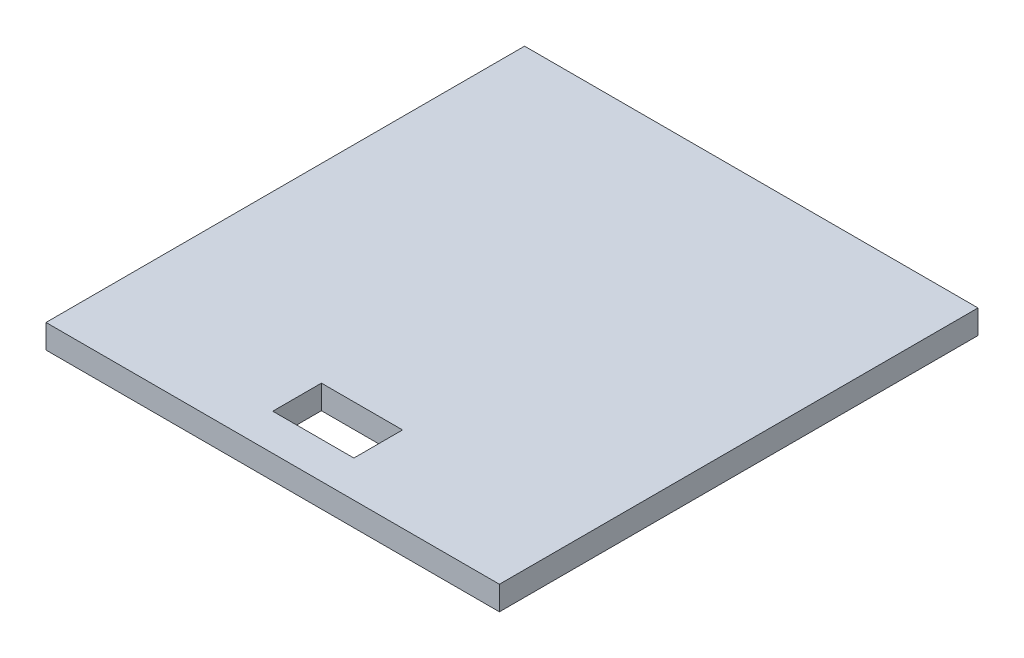
ISO-10303-21;
HEADER;
FILE_DESCRIPTION(('STEP AP214'),'2;1');
FILE_NAME('part.step','',(''),(''),'','','');
FILE_SCHEMA(('AUTOMOTIVE_DESIGN { 1 0 10303 214 1 1 1 1 }'));
ENDSEC;
DATA;
#1=APPLICATION_CONTEXT('core data for automotive mechanical design processes');
#2=APPLICATION_PROTOCOL_DEFINITION('international standard','automotive_design',2000,#1);
#3=PRODUCT_CONTEXT('',#1,'mechanical');
#4=PRODUCT('Part','Part','',(#3));
#5=PRODUCT_RELATED_PRODUCT_CATEGORY('part','',(#4));
#6=PRODUCT_DEFINITION_FORMATION('','',#4);
#7=PRODUCT_DEFINITION_CONTEXT('part definition',#1,'design');
#8=PRODUCT_DEFINITION('design','',#6,#7);
#9=PRODUCT_DEFINITION_SHAPE('','',#8);
#10=(LENGTH_UNIT() NAMED_UNIT(*) SI_UNIT(.MILLI.,.METRE.));
#11=(NAMED_UNIT(*) PLANE_ANGLE_UNIT() SI_UNIT($,.RADIAN.));
#12=(NAMED_UNIT(*) SI_UNIT($,.STERADIAN.) SOLID_ANGLE_UNIT());
#13=UNCERTAINTY_MEASURE_WITH_UNIT(LENGTH_MEASURE(1.E-05),#10,'distance_accuracy_value','');
#14=(GEOMETRIC_REPRESENTATION_CONTEXT(3) GLOBAL_UNCERTAINTY_ASSIGNED_CONTEXT((#13)) GLOBAL_UNIT_ASSIGNED_CONTEXT((#10,
#11,#12)) REPRESENTATION_CONTEXT('',''));
#15=CARTESIAN_POINT('',(0.,0.,0.));
#16=DIRECTION('',(0.,0.,1.));
#17=DIRECTION('',(1.,0.,0.));
#18=AXIS2_PLACEMENT_3D('',#15,#16,#17);
#19=CARTESIAN_POINT('',(-45.0738916256158,2.95,-26.7241379310345));
#20=DIRECTION('',(1.,0.,0.));
#21=DIRECTION('',(0.,0.,-1.));
#22=AXIS2_PLACEMENT_3D('',#19,#20,#21);
#23=PLANE('',#22);
#24=DIRECTION('',(0.,0.,1.));
#25=VECTOR('',#24,1.);
#26=CARTESIAN_POINT('',(-45.0738916256158,0.,-26.7241379310345));
#27=LINE('',#26,#25);
#28=CARTESIAN_POINT('',(-45.0738916256158,0.,-26.7241379310345));
#29=VERTEX_POINT('',#28);
#30=CARTESIAN_POINT('',(-45.0738916256158,0.,32.2758620689655));
#31=VERTEX_POINT('',#30);
#32=EDGE_CURVE('E123',#29,#31,#27,.T.);
#33=ORIENTED_EDGE('',*,*,#32,.T.);
#34=DIRECTION('',(0.,-1.,0.));
#35=VECTOR('',#34,1.);
#36=CARTESIAN_POINT('',(-45.0738916256158,2.95,32.2758620689655));
#37=LINE('',#36,#35);
#38=CARTESIAN_POINT('',(-45.0738916256158,2.95,32.2758620689655));
#39=VERTEX_POINT('',#38);
#40=EDGE_CURVE('E152',#39,#31,#37,.T.);
#41=ORIENTED_EDGE('',*,*,#40,.F.);
#42=DIRECTION('',(0.,0.,1.));
#43=VECTOR('',#42,1.);
#44=CARTESIAN_POINT('',(-45.0738916256158,2.95,-26.7241379310345));
#45=LINE('',#44,#43);
#46=CARTESIAN_POINT('',(-45.0738916256158,2.95,-26.7241379310345));
#47=VERTEX_POINT('',#46);
#48=EDGE_CURVE('E126',#47,#39,#45,.T.);
#49=ORIENTED_EDGE('',*,*,#48,.F.);
#50=DIRECTION('',(0.,-1.,0.));
#51=VECTOR('',#50,1.);
#52=CARTESIAN_POINT('',(-45.0738916256158,2.95,-26.7241379310345));
#53=LINE('',#52,#51);
#54=EDGE_CURVE('E136',#47,#29,#53,.T.);
#55=ORIENTED_EDGE('',*,*,#54,.T.);
#56=EDGE_LOOP('',(#33,#41,#49,#55));
#57=FACE_BOUND('',#56,.T.);
#58=ADVANCED_FACE('F33',(#57),#23,.F.);
#59=CARTESIAN_POINT('',(-45.0738916256158,2.95,32.2758620689655));
#60=DIRECTION('',(0.,0.,-1.));
#61=DIRECTION('',(-1.,0.,0.));
#62=AXIS2_PLACEMENT_3D('',#59,#60,#61);
#63=PLANE('',#62);
#64=DIRECTION('',(1.,0.,0.));
#65=VECTOR('',#64,1.);
#66=CARTESIAN_POINT('',(-45.0738916256158,0.,32.2758620689655));
#67=LINE('',#66,#65);
#68=CARTESIAN_POINT('',(10.8261083743842,0.,32.2758620689655));
#69=VERTEX_POINT('',#68);
#70=EDGE_CURVE('E139',#31,#69,#67,.T.);
#71=ORIENTED_EDGE('',*,*,#70,.T.);
#72=DIRECTION('',(0.,-1.,0.));
#73=VECTOR('',#72,1.);
#74=CARTESIAN_POINT('',(10.8261083743842,2.95,32.2758620689655));
#75=LINE('',#74,#73);
#76=CARTESIAN_POINT('',(10.8261083743842,2.95,32.2758620689655));
#77=VERTEX_POINT('',#76);
#78=EDGE_CURVE('E149',#77,#69,#75,.T.);
#79=ORIENTED_EDGE('',*,*,#78,.F.);
#80=DIRECTION('',(1.,0.,0.));
#81=VECTOR('',#80,1.);
#82=CARTESIAN_POINT('',(-45.0738916256158,2.95,32.2758620689655));
#83=LINE('',#82,#81);
#84=EDGE_CURVE('E129',#39,#77,#83,.T.);
#85=ORIENTED_EDGE('',*,*,#84,.F.);
#86=ORIENTED_EDGE('',*,*,#40,.T.);
#87=EDGE_LOOP('',(#71,#79,#85,#86));
#88=FACE_BOUND('',#87,.T.);
#89=ADVANCED_FACE('F176',(#88),#63,.F.);
#90=CARTESIAN_POINT('',(10.8261083743842,2.95,-26.7241379310345));
#91=DIRECTION('',(-1.,0.,0.));
#92=DIRECTION('',(0.,0.,1.));
#93=AXIS2_PLACEMENT_3D('',#90,#91,#92);
#94=PLANE('',#93);
#95=DIRECTION('',(0.,0.,-1.));
#96=VECTOR('',#95,1.);
#97=CARTESIAN_POINT('',(10.8261083743842,0.,-26.7241379310345));
#98=LINE('',#97,#96);
#99=CARTESIAN_POINT('',(10.8261083743842,0.,-26.7241379310345));
#100=VERTEX_POINT('',#99);
#101=EDGE_CURVE('E141',#69,#100,#98,.T.);
#102=ORIENTED_EDGE('',*,*,#101,.T.);
#103=DIRECTION('',(0.,-1.,0.));
#104=VECTOR('',#103,1.);
#105=CARTESIAN_POINT('',(10.8261083743842,2.95,-26.7241379310345));
#106=LINE('',#105,#104);
#107=CARTESIAN_POINT('',(10.8261083743842,2.95,-26.7241379310345));
#108=VERTEX_POINT('',#107);
#109=EDGE_CURVE('E146',#108,#100,#106,.T.);
#110=ORIENTED_EDGE('',*,*,#109,.F.);
#111=DIRECTION('',(0.,0.,-1.));
#112=VECTOR('',#111,1.);
#113=CARTESIAN_POINT('',(10.8261083743842,2.95,-26.7241379310345));
#114=LINE('',#113,#112);
#115=EDGE_CURVE('E132',#77,#108,#114,.T.);
#116=ORIENTED_EDGE('',*,*,#115,.F.);
#117=ORIENTED_EDGE('',*,*,#78,.T.);
#118=EDGE_LOOP('',(#102,#110,#116,#117));
#119=FACE_BOUND('',#118,.T.);
#120=ADVANCED_FACE('F181',(#119),#94,.F.);
#121=CARTESIAN_POINT('',(-45.0738916256158,2.95,-26.7241379310345));
#122=DIRECTION('',(0.,0.,1.));
#123=DIRECTION('',(1.,0.,0.));
#124=AXIS2_PLACEMENT_3D('',#121,#122,#123);
#125=PLANE('',#124);
#126=DIRECTION('',(-1.,0.,0.));
#127=VECTOR('',#126,1.);
#128=CARTESIAN_POINT('',(-45.0738916256158,0.,-26.7241379310345));
#129=LINE('',#128,#127);
#130=EDGE_CURVE('E130',#100,#29,#129,.T.);
#131=ORIENTED_EDGE('',*,*,#130,.T.);
#132=ORIENTED_EDGE('',*,*,#54,.F.);
#133=DIRECTION('',(-1.,0.,0.));
#134=VECTOR('',#133,1.);
#135=CARTESIAN_POINT('',(-45.0738916256158,2.95,-26.7241379310345));
#136=LINE('',#135,#134);
#137=EDGE_CURVE('E134',#108,#47,#136,.T.);
#138=ORIENTED_EDGE('',*,*,#137,.F.);
#139=ORIENTED_EDGE('',*,*,#109,.T.);
#140=EDGE_LOOP('',(#131,#132,#138,#139));
#141=FACE_BOUND('',#140,.T.);
#142=ADVANCED_FACE('F194',(#141),#125,.F.);
#143=CARTESIAN_POINT('',(0.,2.95,0.));
#144=DIRECTION('',(0.,1.,0.));
#145=DIRECTION('',(0.,0.,1.));
#146=AXIS2_PLACEMENT_3D('',#143,#144,#145);
#147=PLANE('',#146);
#148=DIRECTION('',(0.,0.,1.));
#149=VECTOR('',#148,1.);
#150=CARTESIAN_POINT('',(-21.6190026286885,2.95,21.7758620689655));
#151=LINE('',#150,#149);
#152=CARTESIAN_POINT('',(-21.6190026286885,2.95,21.7758620689655));
#153=VERTEX_POINT('',#152);
#154=CARTESIAN_POINT('',(-21.6190026286885,2.95,27.7758620689655));
#155=VERTEX_POINT('',#154);
#156=EDGE_CURVE('E47',#153,#155,#151,.T.);
#157=ORIENTED_EDGE('',*,*,#156,.F.);
#158=DIRECTION('',(-1.,0.,0.));
#159=VECTOR('',#158,1.);
#160=CARTESIAN_POINT('',(-21.6190026286885,2.95,21.7758620689655));
#161=LINE('',#160,#159);
#162=CARTESIAN_POINT('',(-11.6190026286885,2.95,21.7758620689655));
#163=VERTEX_POINT('',#162);
#164=EDGE_CURVE('E116',#163,#153,#161,.T.);
#165=ORIENTED_EDGE('',*,*,#164,.F.);
#166=DIRECTION('',(0.,0.,-1.));
#167=VECTOR('',#166,1.);
#168=CARTESIAN_POINT('',(-11.6190026286885,2.95,21.7758620689655));
#169=LINE('',#168,#167);
#170=CARTESIAN_POINT('',(-11.6190026286885,2.95,27.7758620689655));
#171=VERTEX_POINT('',#170);
#172=EDGE_CURVE('E100',#171,#163,#169,.T.);
#173=ORIENTED_EDGE('',*,*,#172,.F.);
#174=DIRECTION('',(1.,0.,0.));
#175=VECTOR('',#174,1.);
#176=CARTESIAN_POINT('',(-21.6190026286885,2.95,27.7758620689655));
#177=LINE('',#176,#175);
#178=EDGE_CURVE('E109',#155,#171,#177,.T.);
#179=ORIENTED_EDGE('',*,*,#178,.F.);
#180=EDGE_LOOP('',(#157,#165,#173,#179));
#181=FACE_BOUND('',#180,.T.);
#182=ORIENTED_EDGE('',*,*,#48,.T.);
#183=ORIENTED_EDGE('',*,*,#84,.T.);
#184=ORIENTED_EDGE('',*,*,#115,.T.);
#185=ORIENTED_EDGE('',*,*,#137,.T.);
#186=EDGE_LOOP('',(#182,#183,#184,#185));
#187=FACE_BOUND('',#186,.T.);
#188=ADVANCED_FACE('F113',(#181,#187),#147,.T.);
#189=CARTESIAN_POINT('',(0.,0.,0.));
#190=DIRECTION('',(0.,1.,0.));
#191=DIRECTION('',(0.,0.,1.));
#192=AXIS2_PLACEMENT_3D('',#189,#190,#191);
#193=PLANE('',#192);
#194=DIRECTION('',(-1.,0.,0.));
#195=VECTOR('',#194,1.);
#196=CARTESIAN_POINT('',(0.,0.,21.7758620689655));
#197=LINE('',#196,#195);
#198=CARTESIAN_POINT('',(-11.6190026286885,0.,21.7758620689655));
#199=VERTEX_POINT('',#198);
#200=CARTESIAN_POINT('',(-21.6190026286885,0.,21.7758620689655));
#201=VERTEX_POINT('',#200);
#202=EDGE_CURVE('E40',#199,#201,#197,.T.);
#203=ORIENTED_EDGE('',*,*,#202,.T.);
#204=DIRECTION('',(0.,0.,1.));
#205=VECTOR('',#204,1.);
#206=CARTESIAN_POINT('',(-21.6190026286885,0.,0.));
#207=LINE('',#206,#205);
#208=CARTESIAN_POINT('',(-21.6190026286885,0.,27.7758620689655));
#209=VERTEX_POINT('',#208);
#210=EDGE_CURVE('E11',#201,#209,#207,.T.);
#211=ORIENTED_EDGE('',*,*,#210,.T.);
#212=DIRECTION('',(1.,0.,0.));
#213=VECTOR('',#212,1.);
#214=CARTESIAN_POINT('',(0.,0.,27.7758620689655));
#215=LINE('',#214,#213);
#216=CARTESIAN_POINT('',(-11.6190026286885,0.,27.7758620689655));
#217=VERTEX_POINT('',#216);
#218=EDGE_CURVE('E155',#209,#217,#215,.T.);
#219=ORIENTED_EDGE('',*,*,#218,.T.);
#220=DIRECTION('',(0.,0.,-1.));
#221=VECTOR('',#220,1.);
#222=CARTESIAN_POINT('',(-11.6190026286884,0.,0.));
#223=LINE('',#222,#221);
#224=EDGE_CURVE('E103',#217,#199,#223,.T.);
#225=ORIENTED_EDGE('',*,*,#224,.T.);
#226=EDGE_LOOP('',(#203,#211,#219,#225));
#227=FACE_BOUND('',#226,.T.);
#228=ORIENTED_EDGE('',*,*,#32,.F.);
#229=ORIENTED_EDGE('',*,*,#130,.F.);
#230=ORIENTED_EDGE('',*,*,#101,.F.);
#231=ORIENTED_EDGE('',*,*,#70,.F.);
#232=EDGE_LOOP('',(#228,#229,#230,#231));
#233=FACE_BOUND('',#232,.T.);
#234=ADVANCED_FACE('F159',(#227,#233),#193,.F.);
#235=CARTESIAN_POINT('',(-21.6190026286885,-3.91,21.7758620689655));
#236=DIRECTION('',(-1.,0.,0.));
#237=DIRECTION('',(0.,0.,1.));
#238=AXIS2_PLACEMENT_3D('',#235,#236,#237);
#239=PLANE('',#238);
#240=DIRECTION('',(0.,1.,0.));
#241=VECTOR('',#240,1.);
#242=CARTESIAN_POINT('',(-21.6190026286885,-3.91,21.7758620689655));
#243=LINE('',#242,#241);
#244=EDGE_CURVE('E121',#201,#153,#243,.T.);
#245=ORIENTED_EDGE('',*,*,#244,.T.);
#246=ORIENTED_EDGE('',*,*,#156,.T.);
#247=DIRECTION('',(0.,1.,0.));
#248=VECTOR('',#247,1.);
#249=CARTESIAN_POINT('',(-21.6190026286885,-3.91,27.7758620689655));
#250=LINE('',#249,#248);
#251=EDGE_CURVE('E106',#209,#155,#250,.T.);
#252=ORIENTED_EDGE('',*,*,#251,.F.);
#253=ORIENTED_EDGE('',*,*,#210,.F.);
#254=EDGE_LOOP('',(#245,#246,#252,#253));
#255=FACE_BOUND('',#254,.T.);
#256=ADVANCED_FACE('F164',(#255),#239,.F.);
#257=CARTESIAN_POINT('',(-21.6190026286885,-3.91,21.7758620689655));
#258=DIRECTION('',(0.,0.,-1.));
#259=DIRECTION('',(-1.,0.,0.));
#260=AXIS2_PLACEMENT_3D('',#257,#258,#259);
#261=PLANE('',#260);
#262=DIRECTION('',(0.,1.,0.));
#263=VECTOR('',#262,1.);
#264=CARTESIAN_POINT('',(-11.6190026286885,-3.91,21.7758620689655));
#265=LINE('',#264,#263);
#266=EDGE_CURVE('E105',#199,#163,#265,.T.);
#267=ORIENTED_EDGE('',*,*,#266,.T.);
#268=ORIENTED_EDGE('',*,*,#164,.T.);
#269=ORIENTED_EDGE('',*,*,#244,.F.);
#270=ORIENTED_EDGE('',*,*,#202,.F.);
#271=EDGE_LOOP('',(#267,#268,#269,#270));
#272=FACE_BOUND('',#271,.T.);
#273=ADVANCED_FACE('F163',(#272),#261,.F.);
#274=CARTESIAN_POINT('',(-11.6190026286885,-3.91,21.7758620689655));
#275=DIRECTION('',(1.,0.,0.));
#276=DIRECTION('',(0.,0.,-1.));
#277=AXIS2_PLACEMENT_3D('',#274,#275,#276);
#278=PLANE('',#277);
#279=DIRECTION('',(0.,1.,0.));
#280=VECTOR('',#279,1.);
#281=CARTESIAN_POINT('',(-11.6190026286885,-3.91,27.7758620689655));
#282=LINE('',#281,#280);
#283=EDGE_CURVE('E55',#217,#171,#282,.T.);
#284=ORIENTED_EDGE('',*,*,#283,.T.);
#285=ORIENTED_EDGE('',*,*,#172,.T.);
#286=ORIENTED_EDGE('',*,*,#266,.F.);
#287=ORIENTED_EDGE('',*,*,#224,.F.);
#288=EDGE_LOOP('',(#284,#285,#286,#287));
#289=FACE_BOUND('',#288,.T.);
#290=ADVANCED_FACE('F97',(#289),#278,.F.);
#291=CARTESIAN_POINT('',(-21.6190026286885,-3.91,27.7758620689655));
#292=DIRECTION('',(0.,0.,1.));
#293=DIRECTION('',(1.,0.,0.));
#294=AXIS2_PLACEMENT_3D('',#291,#292,#293);
#295=PLANE('',#294);
#296=ORIENTED_EDGE('',*,*,#251,.T.);
#297=ORIENTED_EDGE('',*,*,#178,.T.);
#298=ORIENTED_EDGE('',*,*,#283,.F.);
#299=ORIENTED_EDGE('',*,*,#218,.F.);
#300=EDGE_LOOP('',(#296,#297,#298,#299));
#301=FACE_BOUND('',#300,.T.);
#302=ADVANCED_FACE('F110',(#301),#295,.F.);
#303=CLOSED_SHELL('',(#58,#89,#120,#142,#188,#234,#256,#273,#290,#302));
#304=MANIFOLD_SOLID_BREP('B2',#303);
#305=ADVANCED_BREP_SHAPE_REPRESENTATION('',(#18,#304),#14);
#306=SHAPE_DEFINITION_REPRESENTATION(#9,#305);
ENDSEC;
END-ISO-10303-21;
